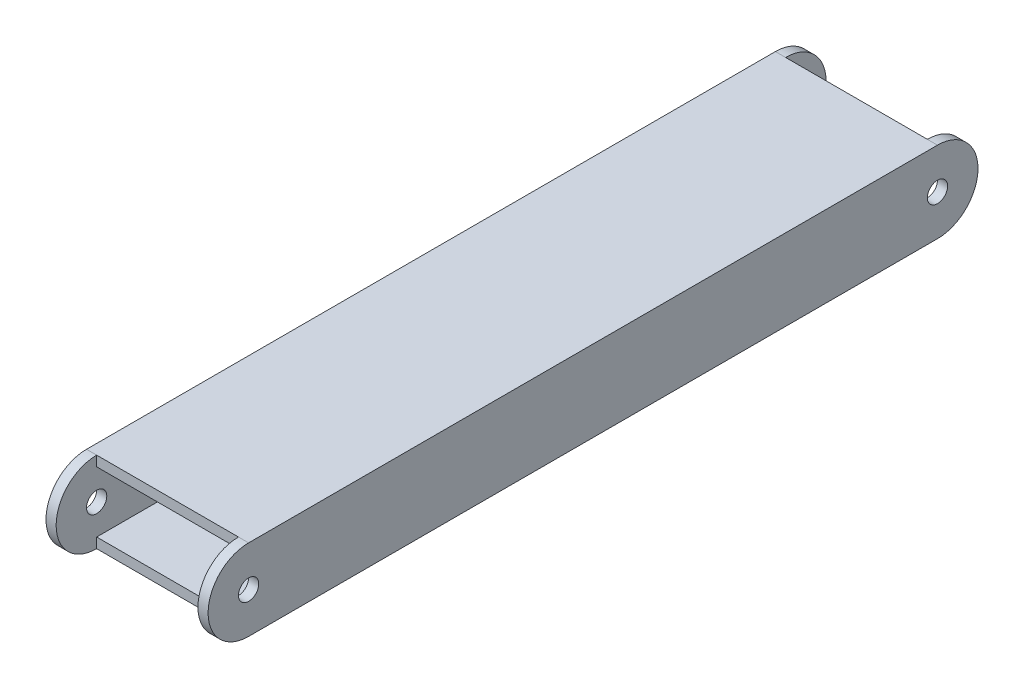
ISO-10303-21;
HEADER;
FILE_DESCRIPTION(('STEP AP214'),'2;1');
FILE_NAME('part.step','',(''),(''),'','','');
FILE_SCHEMA(('AUTOMOTIVE_DESIGN { 1 0 10303 214 1 1 1 1 }'));
ENDSEC;
DATA;
#1=APPLICATION_CONTEXT('core data for automotive mechanical design processes');
#2=APPLICATION_PROTOCOL_DEFINITION('international standard','automotive_design',2000,#1);
#3=PRODUCT_CONTEXT('',#1,'mechanical');
#4=PRODUCT('Part','Part','',(#3));
#5=PRODUCT_RELATED_PRODUCT_CATEGORY('part','',(#4));
#6=PRODUCT_DEFINITION_FORMATION('','',#4);
#7=PRODUCT_DEFINITION_CONTEXT('part definition',#1,'design');
#8=PRODUCT_DEFINITION('design','',#6,#7);
#9=PRODUCT_DEFINITION_SHAPE('','',#8);
#10=(LENGTH_UNIT() NAMED_UNIT(*) SI_UNIT(.MILLI.,.METRE.));
#11=(NAMED_UNIT(*) PLANE_ANGLE_UNIT() SI_UNIT($,.RADIAN.));
#12=(NAMED_UNIT(*) SI_UNIT($,.STERADIAN.) SOLID_ANGLE_UNIT());
#13=UNCERTAINTY_MEASURE_WITH_UNIT(LENGTH_MEASURE(1.E-05),#10,'distance_accuracy_value','');
#14=(GEOMETRIC_REPRESENTATION_CONTEXT(3) GLOBAL_UNCERTAINTY_ASSIGNED_CONTEXT((#13)) GLOBAL_UNIT_ASSIGNED_CONTEXT((#10,
#11,#12)) REPRESENTATION_CONTEXT('',''));
#15=CARTESIAN_POINT('',(0.,0.,0.));
#16=DIRECTION('',(0.,0.,1.));
#17=DIRECTION('',(1.,0.,0.));
#18=AXIS2_PLACEMENT_3D('',#15,#16,#17);
#19=CARTESIAN_POINT('',(0.,0.,215.9));
#20=DIRECTION('',(0.,0.,1.));
#21=DIRECTION('',(1.,0.,0.));
#22=AXIS2_PLACEMENT_3D('',#19,#20,#21);
#23=PLANE('',#22);
#24=DIRECTION('',(0.,-1.,0.));
#25=VECTOR('',#24,1.);
#26=CARTESIAN_POINT('',(22.225,12.7,215.9));
#27=LINE('',#26,#25);
#28=CARTESIAN_POINT('',(22.225,12.7,215.9));
#29=VERTEX_POINT('',#28);
#30=CARTESIAN_POINT('',(22.225,9.525,215.9));
#31=VERTEX_POINT('',#30);
#32=EDGE_CURVE('E206',#29,#31,#27,.T.);
#33=ORIENTED_EDGE('',*,*,#32,.F.);
#34=DIRECTION('',(-1.,0.,0.));
#35=VECTOR('',#34,1.);
#36=CARTESIAN_POINT('',(-25.4,12.7,215.9));
#37=LINE('',#36,#35);
#38=CARTESIAN_POINT('',(-22.225,12.7,215.9));
#39=VERTEX_POINT('',#38);
#40=EDGE_CURVE('E201',#29,#39,#37,.T.);
#41=ORIENTED_EDGE('',*,*,#40,.T.);
#42=DIRECTION('',(0.,1.,0.));
#43=VECTOR('',#42,1.);
#44=CARTESIAN_POINT('',(-22.225,-12.7,215.9));
#45=LINE('',#44,#43);
#46=CARTESIAN_POINT('',(-22.225,9.525,215.9));
#47=VERTEX_POINT('',#46);
#48=EDGE_CURVE('E376',#47,#39,#45,.T.);
#49=ORIENTED_EDGE('',*,*,#48,.F.);
#50=DIRECTION('',(-1.,0.,0.));
#51=VECTOR('',#50,1.);
#52=CARTESIAN_POINT('',(0.,9.525,215.9));
#53=LINE('',#52,#51);
#54=EDGE_CURVE('E217',#31,#47,#53,.T.);
#55=ORIENTED_EDGE('',*,*,#54,.F.);
#56=EDGE_LOOP('',(#33,#41,#49,#55));
#57=FACE_BOUND('',#56,.T.);
#58=ADVANCED_FACE('F71',(#57),#23,.T.);
#59=CARTESIAN_POINT('',(0.,0.,0.));
#60=DIRECTION('',(0.,0.,1.));
#61=DIRECTION('',(1.,0.,0.));
#62=AXIS2_PLACEMENT_3D('',#59,#60,#61);
#63=PLANE('',#62);
#64=DIRECTION('',(-1.,0.,0.));
#65=VECTOR('',#64,1.);
#66=CARTESIAN_POINT('',(-25.4,12.7,0.));
#67=LINE('',#66,#65);
#68=CARTESIAN_POINT('',(22.225,12.7,0.));
#69=VERTEX_POINT('',#68);
#70=CARTESIAN_POINT('',(-22.225,12.7,0.));
#71=VERTEX_POINT('',#70);
#72=EDGE_CURVE('E93',#69,#71,#67,.T.);
#73=ORIENTED_EDGE('',*,*,#72,.F.);
#74=DIRECTION('',(0.,-1.,0.));
#75=VECTOR('',#74,1.);
#76=CARTESIAN_POINT('',(22.225,12.7,0.));
#77=LINE('',#76,#75);
#78=CARTESIAN_POINT('',(22.225,9.525,0.));
#79=VERTEX_POINT('',#78);
#80=EDGE_CURVE('E339',#69,#79,#77,.T.);
#81=ORIENTED_EDGE('',*,*,#80,.T.);
#82=DIRECTION('',(-1.,0.,0.));
#83=VECTOR('',#82,1.);
#84=CARTESIAN_POINT('',(0.,9.525,0.));
#85=LINE('',#84,#83);
#86=CARTESIAN_POINT('',(-22.225,9.525,0.));
#87=VERTEX_POINT('',#86);
#88=EDGE_CURVE('E256',#79,#87,#85,.T.);
#89=ORIENTED_EDGE('',*,*,#88,.T.);
#90=DIRECTION('',(0.,1.,0.));
#91=VECTOR('',#90,1.);
#92=CARTESIAN_POINT('',(-22.225,-12.7,0.));
#93=LINE('',#92,#91);
#94=EDGE_CURVE('E284',#87,#71,#93,.T.);
#95=ORIENTED_EDGE('',*,*,#94,.T.);
#96=EDGE_LOOP('',(#73,#81,#89,#95));
#97=FACE_BOUND('',#96,.T.);
#98=ADVANCED_FACE('F477',(#97),#63,.F.);
#99=CARTESIAN_POINT('',(22.225,-9.525,215.9));
#100=VERTEX_POINT('',#99);
#101=CARTESIAN_POINT('',(22.225,-12.7,215.9));
#102=VERTEX_POINT('',#101);
#103=EDGE_CURVE('E209',#100,#102,#27,.T.);
#104=ORIENTED_EDGE('',*,*,#103,.F.);
#105=DIRECTION('',(1.,0.,0.));
#106=VECTOR('',#105,1.);
#107=CARTESIAN_POINT('',(0.,-9.525,215.9));
#108=LINE('',#107,#106);
#109=CARTESIAN_POINT('',(-22.225,-9.525,215.9));
#110=VERTEX_POINT('',#109);
#111=EDGE_CURVE('E262',#110,#100,#108,.T.);
#112=ORIENTED_EDGE('',*,*,#111,.F.);
#113=CARTESIAN_POINT('',(-22.225,-12.7,215.9));
#114=VERTEX_POINT('',#113);
#115=EDGE_CURVE('E559',#114,#110,#45,.T.);
#116=ORIENTED_EDGE('',*,*,#115,.F.);
#117=DIRECTION('',(1.,0.,0.));
#118=VECTOR('',#117,1.);
#119=CARTESIAN_POINT('',(-25.4,-12.7,215.9));
#120=LINE('',#119,#118);
#121=EDGE_CURVE('E200',#114,#102,#120,.T.);
#122=ORIENTED_EDGE('',*,*,#121,.T.);
#123=EDGE_LOOP('',(#104,#112,#116,#122));
#124=FACE_BOUND('',#123,.T.);
#125=ADVANCED_FACE('F478',(#124),#23,.T.);
#126=DIRECTION('',(1.,0.,0.));
#127=VECTOR('',#126,1.);
#128=CARTESIAN_POINT('',(0.,-9.525,0.));
#129=LINE('',#128,#127);
#130=CARTESIAN_POINT('',(-22.225,-9.525,0.));
#131=VERTEX_POINT('',#130);
#132=CARTESIAN_POINT('',(22.225,-9.525,0.));
#133=VERTEX_POINT('',#132);
#134=EDGE_CURVE('E260',#131,#133,#129,.T.);
#135=ORIENTED_EDGE('',*,*,#134,.T.);
#136=CARTESIAN_POINT('',(22.225,-12.7,0.));
#137=VERTEX_POINT('',#136);
#138=EDGE_CURVE('E104',#133,#137,#77,.T.);
#139=ORIENTED_EDGE('',*,*,#138,.T.);
#140=DIRECTION('',(1.,0.,0.));
#141=VECTOR('',#140,1.);
#142=CARTESIAN_POINT('',(-25.4,-12.7,0.));
#143=LINE('',#142,#141);
#144=CARTESIAN_POINT('',(-22.225,-12.7,0.));
#145=VERTEX_POINT('',#144);
#146=EDGE_CURVE('E228',#145,#137,#143,.T.);
#147=ORIENTED_EDGE('',*,*,#146,.F.);
#148=EDGE_CURVE('E277',#145,#131,#93,.T.);
#149=ORIENTED_EDGE('',*,*,#148,.T.);
#150=EDGE_LOOP('',(#135,#139,#147,#149));
#151=FACE_BOUND('',#150,.T.);
#152=ADVANCED_FACE('F483',(#151),#63,.F.);
#153=CARTESIAN_POINT('',(25.4,-12.7,215.9));
#154=DIRECTION('',(-1.,0.,0.));
#155=DIRECTION('',(0.,0.,1.));
#156=AXIS2_PLACEMENT_3D('',#153,#154,#155);
#157=PLANE('',#156);
#158=CARTESIAN_POINT('',(25.4,0.,215.9));
#159=DIRECTION('',(-1.,0.,0.));
#160=DIRECTION('',(0.,0.,1.));
#161=AXIS2_PLACEMENT_3D('',#158,#159,#160);
#162=CIRCLE('',#161,3.175);
#163=CARTESIAN_POINT('',(25.4,0.,219.075));
#164=VERTEX_POINT('',#163);
#165=EDGE_CURVE('E546',#164,#164,#162,.T.);
#166=ORIENTED_EDGE('',*,*,#165,.T.);
#167=EDGE_LOOP('',(#166));
#168=FACE_BOUND('',#167,.T.);
#169=CARTESIAN_POINT('',(25.4,0.,0.));
#170=DIRECTION('',(1.,0.,0.));
#171=DIRECTION('',(0.,0.,-1.));
#172=AXIS2_PLACEMENT_3D('',#169,#170,#171);
#173=CIRCLE('',#172,3.175);
#174=CARTESIAN_POINT('',(25.4,0.,-3.175));
#175=VERTEX_POINT('',#174);
#176=EDGE_CURVE('E430',#175,#175,#173,.T.);
#177=ORIENTED_EDGE('',*,*,#176,.F.);
#178=EDGE_LOOP('',(#177));
#179=FACE_BOUND('',#178,.T.);
#180=DIRECTION('',(0.,0.,-1.));
#181=VECTOR('',#180,1.);
#182=CARTESIAN_POINT('',(25.4,-12.7,215.9));
#183=LINE('',#182,#181);
#184=CARTESIAN_POINT('',(25.4,-12.7,215.9));
#185=VERTEX_POINT('',#184);
#186=CARTESIAN_POINT('',(25.4,-12.7,0.));
#187=VERTEX_POINT('',#186);
#188=EDGE_CURVE('E349',#185,#187,#183,.T.);
#189=ORIENTED_EDGE('',*,*,#188,.T.);
#190=CARTESIAN_POINT('',(25.4,0.,0.));
#191=DIRECTION('',(1.,0.,0.));
#192=DIRECTION('',(0.,0.,-1.));
#193=AXIS2_PLACEMENT_3D('',#190,#191,#192);
#194=CIRCLE('',#193,12.7);
#195=CARTESIAN_POINT('',(25.4,12.7,0.));
#196=VERTEX_POINT('',#195);
#197=EDGE_CURVE('E331',#187,#196,#194,.T.);
#198=ORIENTED_EDGE('',*,*,#197,.T.);
#199=DIRECTION('',(0.,0.,-1.));
#200=VECTOR('',#199,1.);
#201=CARTESIAN_POINT('',(25.4,12.7,215.9));
#202=LINE('',#201,#200);
#203=CARTESIAN_POINT('',(25.4,12.7,215.9));
#204=VERTEX_POINT('',#203);
#205=EDGE_CURVE('E13',#204,#196,#202,.T.);
#206=ORIENTED_EDGE('',*,*,#205,.F.);
#207=CARTESIAN_POINT('',(25.4,0.,215.9));
#208=DIRECTION('',(-1.,0.,0.));
#209=DIRECTION('',(0.,0.,1.));
#210=AXIS2_PLACEMENT_3D('',#207,#208,#209);
#211=CIRCLE('',#210,12.7);
#212=EDGE_CURVE('E195',#185,#204,#211,.T.);
#213=ORIENTED_EDGE('',*,*,#212,.F.);
#214=EDGE_LOOP('',(#189,#198,#206,#213));
#215=FACE_BOUND('',#214,.T.);
#216=ADVANCED_FACE('F74',(#168,#179,#215),#157,.F.);
#217=CARTESIAN_POINT('',(-25.4,12.7,215.9));
#218=DIRECTION('',(0.,-1.,0.));
#219=DIRECTION('',(0.,0.,-1.));
#220=AXIS2_PLACEMENT_3D('',#217,#218,#219);
#221=PLANE('',#220);
#222=EDGE_CURVE('E315',#196,#69,#67,.T.);
#223=ORIENTED_EDGE('',*,*,#222,.T.);
#224=ORIENTED_EDGE('',*,*,#72,.T.);
#225=DIRECTION('',(-1.,0.,0.));
#226=VECTOR('',#225,1.);
#227=CARTESIAN_POINT('',(6.17306331424734,12.7,0.));
#228=LINE('',#227,#226);
#229=CARTESIAN_POINT('',(-25.4,12.7,0.));
#230=VERTEX_POINT('',#229);
#231=EDGE_CURVE('E283',#71,#230,#228,.T.);
#232=ORIENTED_EDGE('',*,*,#231,.T.);
#233=DIRECTION('',(0.,0.,-1.));
#234=VECTOR('',#233,1.);
#235=CARTESIAN_POINT('',(-25.4,12.7,215.9));
#236=LINE('',#235,#234);
#237=CARTESIAN_POINT('',(-25.4,12.7,215.9));
#238=VERTEX_POINT('',#237);
#239=EDGE_CURVE('E82',#238,#230,#236,.T.);
#240=ORIENTED_EDGE('',*,*,#239,.F.);
#241=DIRECTION('',(-1.,0.,0.));
#242=VECTOR('',#241,1.);
#243=CARTESIAN_POINT('',(6.17306331424732,12.7,215.9));
#244=LINE('',#243,#242);
#245=EDGE_CURVE('E211',#39,#238,#244,.T.);
#246=ORIENTED_EDGE('',*,*,#245,.F.);
#247=ORIENTED_EDGE('',*,*,#40,.F.);
#248=EDGE_CURVE('E189',#204,#29,#37,.T.);
#249=ORIENTED_EDGE('',*,*,#248,.F.);
#250=ORIENTED_EDGE('',*,*,#205,.T.);
#251=EDGE_LOOP('',(#223,#224,#232,#240,#246,#247,#249,#250));
#252=FACE_BOUND('',#251,.T.);
#253=ADVANCED_FACE('F221',(#252),#221,.F.);
#254=CARTESIAN_POINT('',(-25.4,-12.7,215.9));
#255=DIRECTION('',(1.,0.,0.));
#256=DIRECTION('',(0.,0.,-1.));
#257=AXIS2_PLACEMENT_3D('',#254,#255,#256);
#258=PLANE('',#257);
#259=CARTESIAN_POINT('',(-25.4,0.,215.9));
#260=DIRECTION('',(1.,0.,0.));
#261=DIRECTION('',(0.,0.,-1.));
#262=AXIS2_PLACEMENT_3D('',#259,#260,#261);
#263=CIRCLE('',#262,3.175);
#264=CARTESIAN_POINT('',(-25.4,0.,212.725));
#265=VERTEX_POINT('',#264);
#266=EDGE_CURVE('E542',#265,#265,#263,.T.);
#267=ORIENTED_EDGE('',*,*,#266,.T.);
#268=EDGE_LOOP('',(#267));
#269=FACE_BOUND('',#268,.T.);
#270=CARTESIAN_POINT('',(-25.4,0.,0.));
#271=DIRECTION('',(1.,0.,0.));
#272=DIRECTION('',(0.,0.,-1.));
#273=AXIS2_PLACEMENT_3D('',#270,#271,#272);
#274=CIRCLE('',#273,3.175);
#275=CARTESIAN_POINT('',(-25.4,0.,-3.175));
#276=VERTEX_POINT('',#275);
#277=EDGE_CURVE('E434',#276,#276,#274,.F.);
#278=ORIENTED_EDGE('',*,*,#277,.F.);
#279=EDGE_LOOP('',(#278));
#280=FACE_BOUND('',#279,.T.);
#281=ORIENTED_EDGE('',*,*,#239,.T.);
#282=CARTESIAN_POINT('',(-25.4,0.,0.));
#283=DIRECTION('',(-1.,0.,0.));
#284=DIRECTION('',(0.,0.,1.));
#285=AXIS2_PLACEMENT_3D('',#282,#283,#284);
#286=CIRCLE('',#285,12.7);
#287=CARTESIAN_POINT('',(-25.4,-12.7,0.));
#288=VERTEX_POINT('',#287);
#289=EDGE_CURVE('E285',#230,#288,#286,.T.);
#290=ORIENTED_EDGE('',*,*,#289,.T.);
#291=DIRECTION('',(0.,0.,-1.));
#292=VECTOR('',#291,1.);
#293=CARTESIAN_POINT('',(-25.4,-12.7,215.9));
#294=LINE('',#293,#292);
#295=CARTESIAN_POINT('',(-25.4,-12.7,215.9));
#296=VERTEX_POINT('',#295);
#297=EDGE_CURVE('E354',#296,#288,#294,.T.);
#298=ORIENTED_EDGE('',*,*,#297,.F.);
#299=CARTESIAN_POINT('',(-25.4,0.,215.9));
#300=DIRECTION('',(1.,0.,0.));
#301=DIRECTION('',(0.,0.,-1.));
#302=AXIS2_PLACEMENT_3D('',#299,#300,#301);
#303=CIRCLE('',#302,12.7);
#304=EDGE_CURVE('E370',#238,#296,#303,.T.);
#305=ORIENTED_EDGE('',*,*,#304,.F.);
#306=EDGE_LOOP('',(#281,#290,#298,#305));
#307=FACE_BOUND('',#306,.T.);
#308=ADVANCED_FACE('F470',(#269,#280,#307),#258,.F.);
#309=CARTESIAN_POINT('',(-25.4,-12.7,215.9));
#310=DIRECTION('',(0.,1.,0.));
#311=DIRECTION('',(0.,0.,1.));
#312=AXIS2_PLACEMENT_3D('',#309,#310,#311);
#313=PLANE('',#312);
#314=EDGE_CURVE('E224',#288,#145,#143,.T.);
#315=ORIENTED_EDGE('',*,*,#314,.T.);
#316=ORIENTED_EDGE('',*,*,#146,.T.);
#317=DIRECTION('',(1.,0.,0.));
#318=VECTOR('',#317,1.);
#319=CARTESIAN_POINT('',(-6.17306331424734,-12.7,0.));
#320=LINE('',#319,#318);
#321=EDGE_CURVE('E509',#137,#187,#320,.T.);
#322=ORIENTED_EDGE('',*,*,#321,.T.);
#323=ORIENTED_EDGE('',*,*,#188,.F.);
#324=DIRECTION('',(1.,0.,0.));
#325=VECTOR('',#324,1.);
#326=CARTESIAN_POINT('',(-6.17306331424732,-12.7,215.9));
#327=LINE('',#326,#325);
#328=EDGE_CURVE('E364',#102,#185,#327,.T.);
#329=ORIENTED_EDGE('',*,*,#328,.F.);
#330=ORIENTED_EDGE('',*,*,#121,.F.);
#331=EDGE_CURVE('E236',#296,#114,#120,.T.);
#332=ORIENTED_EDGE('',*,*,#331,.F.);
#333=ORIENTED_EDGE('',*,*,#297,.T.);
#334=EDGE_LOOP('',(#315,#316,#322,#323,#329,#330,#332,#333));
#335=FACE_BOUND('',#334,.T.);
#336=ADVANCED_FACE('F460',(#335),#313,.F.);
#337=CARTESIAN_POINT('',(22.225,0.,215.9));
#338=DIRECTION('',(-1.,0.,0.));
#339=DIRECTION('',(0.,0.,1.));
#340=AXIS2_PLACEMENT_3D('',#337,#338,#339);
#341=PLANE('',#340);
#342=CARTESIAN_POINT('',(22.225,0.,215.9));
#343=DIRECTION('',(-1.,0.,0.));
#344=DIRECTION('',(0.,0.,1.));
#345=AXIS2_PLACEMENT_3D('',#342,#343,#344);
#346=CIRCLE('',#345,3.175);
#347=CARTESIAN_POINT('',(22.225,0.,219.075));
#348=VERTEX_POINT('',#347);
#349=EDGE_CURVE('E368',#348,#348,#346,.F.);
#350=ORIENTED_EDGE('',*,*,#349,.T.);
#351=EDGE_LOOP('',(#350));
#352=FACE_BOUND('',#351,.T.);
#353=CARTESIAN_POINT('',(22.225,0.,0.));
#354=DIRECTION('',(-1.,0.,0.));
#355=DIRECTION('',(0.,0.,1.));
#356=AXIS2_PLACEMENT_3D('',#353,#354,#355);
#357=CIRCLE('',#356,3.175);
#358=CARTESIAN_POINT('',(22.225,0.,3.175));
#359=VERTEX_POINT('',#358);
#360=EDGE_CURVE('E336',#359,#359,#357,.T.);
#361=ORIENTED_EDGE('',*,*,#360,.F.);
#362=EDGE_LOOP('',(#361));
#363=FACE_BOUND('',#362,.T.);
#364=DIRECTION('',(0.,0.,-1.));
#365=VECTOR('',#364,1.);
#366=CARTESIAN_POINT('',(22.225,9.525,215.9));
#367=LINE('',#366,#365);
#368=EDGE_CURVE('E233',#31,#79,#367,.T.);
#369=ORIENTED_EDGE('',*,*,#368,.T.);
#370=ORIENTED_EDGE('',*,*,#80,.F.);
#371=CARTESIAN_POINT('',(22.225,0.,0.));
#372=DIRECTION('',(-1.,0.,0.));
#373=DIRECTION('',(0.,0.,1.));
#374=AXIS2_PLACEMENT_3D('',#371,#372,#373);
#375=CIRCLE('',#374,12.7);
#376=EDGE_CURVE('E504',#137,#69,#375,.F.);
#377=ORIENTED_EDGE('',*,*,#376,.F.);
#378=ORIENTED_EDGE('',*,*,#138,.F.);
#379=DIRECTION('',(0.,0.,-1.));
#380=VECTOR('',#379,1.);
#381=CARTESIAN_POINT('',(22.225,-9.525,215.9));
#382=LINE('',#381,#380);
#383=EDGE_CURVE('E421',#100,#133,#382,.T.);
#384=ORIENTED_EDGE('',*,*,#383,.F.);
#385=ORIENTED_EDGE('',*,*,#103,.T.);
#386=CARTESIAN_POINT('',(22.225,0.,215.9));
#387=DIRECTION('',(-1.,0.,0.));
#388=DIRECTION('',(0.,0.,1.));
#389=AXIS2_PLACEMENT_3D('',#386,#387,#388);
#390=CIRCLE('',#389,12.7);
#391=EDGE_CURVE('E192',#102,#29,#390,.T.);
#392=ORIENTED_EDGE('',*,*,#391,.T.);
#393=ORIENTED_EDGE('',*,*,#32,.T.);
#394=EDGE_LOOP('',(#369,#370,#377,#378,#384,#385,#392,#393));
#395=FACE_BOUND('',#394,.T.);
#396=ADVANCED_FACE('F205',(#352,#363,#395),#341,.T.);
#397=CARTESIAN_POINT('',(0.,9.525,215.9));
#398=DIRECTION('',(0.,-1.,0.));
#399=DIRECTION('',(0.,0.,-1.));
#400=AXIS2_PLACEMENT_3D('',#397,#398,#399);
#401=PLANE('',#400);
#402=ORIENTED_EDGE('',*,*,#88,.F.);
#403=ORIENTED_EDGE('',*,*,#368,.F.);
#404=ORIENTED_EDGE('',*,*,#54,.T.);
#405=DIRECTION('',(0.,0.,-1.));
#406=VECTOR('',#405,1.);
#407=CARTESIAN_POINT('',(-22.225,9.525,215.9));
#408=LINE('',#407,#406);
#409=EDGE_CURVE('E304',#47,#87,#408,.T.);
#410=ORIENTED_EDGE('',*,*,#409,.T.);
#411=EDGE_LOOP('',(#402,#403,#404,#410));
#412=FACE_BOUND('',#411,.T.);
#413=ADVANCED_FACE('F459',(#412),#401,.T.);
#414=CARTESIAN_POINT('',(-22.225,0.,215.9));
#415=DIRECTION('',(1.,0.,0.));
#416=DIRECTION('',(0.,0.,-1.));
#417=AXIS2_PLACEMENT_3D('',#414,#415,#416);
#418=PLANE('',#417);
#419=CARTESIAN_POINT('',(-22.225,0.,215.9));
#420=DIRECTION('',(1.,0.,0.));
#421=DIRECTION('',(0.,0.,-1.));
#422=AXIS2_PLACEMENT_3D('',#419,#420,#421);
#423=CIRCLE('',#422,3.175);
#424=CARTESIAN_POINT('',(-22.225,0.,212.725));
#425=VERTEX_POINT('',#424);
#426=EDGE_CURVE('E76',#425,#425,#423,.F.);
#427=ORIENTED_EDGE('',*,*,#426,.T.);
#428=EDGE_LOOP('',(#427));
#429=FACE_BOUND('',#428,.T.);
#430=CARTESIAN_POINT('',(-22.225,0.,0.));
#431=DIRECTION('',(1.,0.,0.));
#432=DIRECTION('',(0.,0.,-1.));
#433=AXIS2_PLACEMENT_3D('',#430,#431,#432);
#434=CIRCLE('',#433,3.175);
#435=CARTESIAN_POINT('',(-22.225,0.,-3.175));
#436=VERTEX_POINT('',#435);
#437=EDGE_CURVE('E400',#436,#436,#434,.T.);
#438=ORIENTED_EDGE('',*,*,#437,.F.);
#439=EDGE_LOOP('',(#438));
#440=FACE_BOUND('',#439,.T.);
#441=DIRECTION('',(0.,0.,-1.));
#442=VECTOR('',#441,1.);
#443=CARTESIAN_POINT('',(-22.225,-9.525,215.9));
#444=LINE('',#443,#442);
#445=EDGE_CURVE('E307',#110,#131,#444,.T.);
#446=ORIENTED_EDGE('',*,*,#445,.T.);
#447=ORIENTED_EDGE('',*,*,#148,.F.);
#448=CARTESIAN_POINT('',(-22.225,0.,0.));
#449=DIRECTION('',(1.,0.,0.));
#450=DIRECTION('',(0.,0.,-1.));
#451=AXIS2_PLACEMENT_3D('',#448,#449,#450);
#452=CIRCLE('',#451,12.7);
#453=EDGE_CURVE('E261',#71,#145,#452,.F.);
#454=ORIENTED_EDGE('',*,*,#453,.F.);
#455=ORIENTED_EDGE('',*,*,#94,.F.);
#456=ORIENTED_EDGE('',*,*,#409,.F.);
#457=ORIENTED_EDGE('',*,*,#48,.T.);
#458=CARTESIAN_POINT('',(-22.225,0.,215.9));
#459=DIRECTION('',(1.,0.,0.));
#460=DIRECTION('',(0.,0.,-1.));
#461=AXIS2_PLACEMENT_3D('',#458,#459,#460);
#462=CIRCLE('',#461,12.7);
#463=EDGE_CURVE('E377',#39,#114,#462,.T.);
#464=ORIENTED_EDGE('',*,*,#463,.T.);
#465=ORIENTED_EDGE('',*,*,#115,.T.);
#466=EDGE_LOOP('',(#446,#447,#454,#455,#456,#457,#464,#465));
#467=FACE_BOUND('',#466,.T.);
#468=ADVANCED_FACE('F467',(#429,#440,#467),#418,.T.);
#469=CARTESIAN_POINT('',(0.,-9.525,215.9));
#470=DIRECTION('',(0.,1.,0.));
#471=DIRECTION('',(0.,0.,1.));
#472=AXIS2_PLACEMENT_3D('',#469,#470,#471);
#473=PLANE('',#472);
#474=ORIENTED_EDGE('',*,*,#134,.F.);
#475=ORIENTED_EDGE('',*,*,#445,.F.);
#476=ORIENTED_EDGE('',*,*,#111,.T.);
#477=ORIENTED_EDGE('',*,*,#383,.T.);
#478=EDGE_LOOP('',(#474,#475,#476,#477));
#479=FACE_BOUND('',#478,.T.);
#480=ADVANCED_FACE('F498',(#479),#473,.T.);
#481=CARTESIAN_POINT('',(6.17306331424734,0.,0.));
#482=DIRECTION('',(-1.,0.,0.));
#483=DIRECTION('',(0.,0.,1.));
#484=AXIS2_PLACEMENT_3D('',#481,#482,#483);
#485=CYLINDRICAL_SURFACE('',#484,12.7);
#486=ORIENTED_EDGE('',*,*,#231,.F.);
#487=ORIENTED_EDGE('',*,*,#453,.T.);
#488=ORIENTED_EDGE('',*,*,#314,.F.);
#489=ORIENTED_EDGE('',*,*,#289,.F.);
#490=EDGE_LOOP('',(#486,#487,#488,#489));
#491=FACE_BOUND('',#490,.T.);
#492=ADVANCED_FACE('F533',(#491),#485,.T.);
#493=CARTESIAN_POINT('',(-6.17306331424734,0.,0.));
#494=DIRECTION('',(1.,0.,0.));
#495=DIRECTION('',(0.,0.,-1.));
#496=AXIS2_PLACEMENT_3D('',#493,#494,#495);
#497=CYLINDRICAL_SURFACE('',#496,12.7);
#498=ORIENTED_EDGE('',*,*,#321,.F.);
#499=ORIENTED_EDGE('',*,*,#376,.T.);
#500=ORIENTED_EDGE('',*,*,#222,.F.);
#501=ORIENTED_EDGE('',*,*,#197,.F.);
#502=EDGE_LOOP('',(#498,#499,#500,#501));
#503=FACE_BOUND('',#502,.T.);
#504=ADVANCED_FACE('F576',(#503),#497,.T.);
#505=CARTESIAN_POINT('',(-34.3802561210691,0.,0.));
#506=DIRECTION('',(1.,0.,0.));
#507=DIRECTION('',(0.,0.,-1.));
#508=AXIS2_PLACEMENT_3D('',#505,#506,#507);
#509=CYLINDRICAL_SURFACE('',#508,3.175);
#510=ORIENTED_EDGE('',*,*,#437,.T.);
#511=EDGE_LOOP('',(#510));
#512=FACE_BOUND('',#511,.T.);
#513=ORIENTED_EDGE('',*,*,#277,.T.);
#514=EDGE_LOOP('',(#513));
#515=FACE_BOUND('',#514,.T.);
#516=ADVANCED_FACE('F578',(#512,#515),#509,.F.);
#517=ORIENTED_EDGE('',*,*,#360,.T.);
#518=EDGE_LOOP('',(#517));
#519=FACE_BOUND('',#518,.T.);
#520=ORIENTED_EDGE('',*,*,#176,.T.);
#521=EDGE_LOOP('',(#520));
#522=FACE_BOUND('',#521,.T.);
#523=ADVANCED_FACE('F455',(#519,#522),#509,.F.);
#524=CARTESIAN_POINT('',(6.17306331424732,0.,215.9));
#525=DIRECTION('',(-1.,0.,0.));
#526=DIRECTION('',(0.,0.,1.));
#527=AXIS2_PLACEMENT_3D('',#524,#525,#526);
#528=CYLINDRICAL_SURFACE('',#527,12.7);
#529=ORIENTED_EDGE('',*,*,#463,.F.);
#530=ORIENTED_EDGE('',*,*,#245,.T.);
#531=ORIENTED_EDGE('',*,*,#304,.T.);
#532=ORIENTED_EDGE('',*,*,#331,.T.);
#533=EDGE_LOOP('',(#529,#530,#531,#532));
#534=FACE_BOUND('',#533,.T.);
#535=ADVANCED_FACE('F538',(#534),#528,.T.);
#536=CARTESIAN_POINT('',(-6.17306331424732,0.,215.9));
#537=DIRECTION('',(1.,0.,0.));
#538=DIRECTION('',(0.,0.,-1.));
#539=AXIS2_PLACEMENT_3D('',#536,#537,#538);
#540=CYLINDRICAL_SURFACE('',#539,12.7);
#541=ORIENTED_EDGE('',*,*,#391,.F.);
#542=ORIENTED_EDGE('',*,*,#328,.T.);
#543=ORIENTED_EDGE('',*,*,#212,.T.);
#544=ORIENTED_EDGE('',*,*,#248,.T.);
#545=EDGE_LOOP('',(#541,#542,#543,#544));
#546=FACE_BOUND('',#545,.T.);
#547=ADVANCED_FACE('F191',(#546),#540,.T.);
#548=CARTESIAN_POINT('',(-34.3802561210692,0.,215.9));
#549=DIRECTION('',(1.,0.,0.));
#550=DIRECTION('',(0.,0.,-1.));
#551=AXIS2_PLACEMENT_3D('',#548,#549,#550);
#552=CYLINDRICAL_SURFACE('',#551,3.175);
#553=ORIENTED_EDGE('',*,*,#426,.F.);
#554=EDGE_LOOP('',(#553));
#555=FACE_BOUND('',#554,.T.);
#556=ORIENTED_EDGE('',*,*,#266,.F.);
#557=EDGE_LOOP('',(#556));
#558=FACE_BOUND('',#557,.T.);
#559=ADVANCED_FACE('F609',(#555,#558),#552,.F.);
#560=ORIENTED_EDGE('',*,*,#349,.F.);
#561=EDGE_LOOP('',(#560));
#562=FACE_BOUND('',#561,.T.);
#563=ORIENTED_EDGE('',*,*,#165,.F.);
#564=EDGE_LOOP('',(#563));
#565=FACE_BOUND('',#564,.T.);
#566=ADVANCED_FACE('F611',(#562,#565),#552,.F.);
#567=CLOSED_SHELL('',(#58,#98,#125,#152,#216,#253,#308,#336,#396,#413,#468,#480,#492,#504,#516,
#523,#535,#547,#559,#566));
#568=MANIFOLD_SOLID_BREP('B2',#567);
#569=ADVANCED_BREP_SHAPE_REPRESENTATION('',(#18,#568),#14);
#570=SHAPE_DEFINITION_REPRESENTATION(#9,#569);
ENDSEC;
END-ISO-10303-21;
